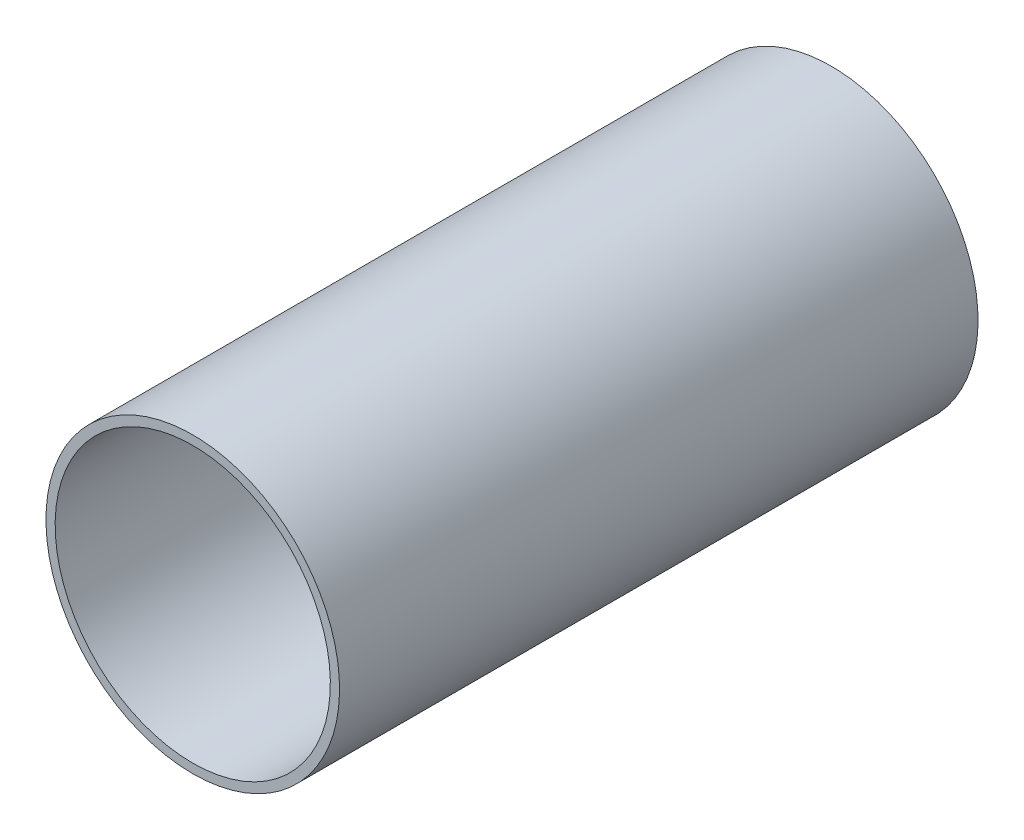
ISO-10303-21;
HEADER;
FILE_DESCRIPTION(('STEP AP214'),'2;1');
FILE_NAME('part.step','',(''),(''),'','','');
FILE_SCHEMA(('AUTOMOTIVE_DESIGN { 1 0 10303 214 1 1 1 1 }'));
ENDSEC;
DATA;
#1=APPLICATION_CONTEXT('core data for automotive mechanical design processes');
#2=APPLICATION_PROTOCOL_DEFINITION('international standard','automotive_design',2000,#1);
#3=PRODUCT_CONTEXT('',#1,'mechanical');
#4=PRODUCT('Part','Part','',(#3));
#5=PRODUCT_RELATED_PRODUCT_CATEGORY('part','',(#4));
#6=PRODUCT_DEFINITION_FORMATION('','',#4);
#7=PRODUCT_DEFINITION_CONTEXT('part definition',#1,'design');
#8=PRODUCT_DEFINITION('design','',#6,#7);
#9=PRODUCT_DEFINITION_SHAPE('','',#8);
#10=(LENGTH_UNIT() NAMED_UNIT(*) SI_UNIT(.MILLI.,.METRE.));
#11=(NAMED_UNIT(*) PLANE_ANGLE_UNIT() SI_UNIT($,.RADIAN.));
#12=(NAMED_UNIT(*) SI_UNIT($,.STERADIAN.) SOLID_ANGLE_UNIT());
#13=UNCERTAINTY_MEASURE_WITH_UNIT(LENGTH_MEASURE(1.E-05),#10,'distance_accuracy_value','');
#14=(GEOMETRIC_REPRESENTATION_CONTEXT(3) GLOBAL_UNCERTAINTY_ASSIGNED_CONTEXT((#13)) GLOBAL_UNIT_ASSIGNED_CONTEXT((#10,
#11,#12)) REPRESENTATION_CONTEXT('',''));
#15=CARTESIAN_POINT('',(0.,0.,0.));
#16=DIRECTION('',(0.,0.,1.));
#17=DIRECTION('',(1.,0.,0.));
#18=AXIS2_PLACEMENT_3D('',#15,#16,#17);
#19=CARTESIAN_POINT('',(124.46,-103.632,-0.045));
#20=DIRECTION('',(0.,0.,-1.));
#21=DIRECTION('',(0.,-1.,0.));
#22=AXIS2_PLACEMENT_3D('',#19,#20,#21);
#23=CYLINDRICAL_SURFACE('',#22,0.375);
#24=CARTESIAN_POINT('',(124.46,-103.632,-0.035));
#25=DIRECTION('',(0.,0.,-1.));
#26=DIRECTION('',(0.,-1.,0.));
#27=AXIS2_PLACEMENT_3D('',#24,#25,#26);
#28=CIRCLE('',#27,0.375);
#29=CARTESIAN_POINT('',(124.46,-104.007,-0.035));
#30=VERTEX_POINT('',#29);
#31=EDGE_CURVE('E64',#30,#30,#28,.T.);
#32=ORIENTED_EDGE('',*,*,#31,.T.);
#33=DIRECTION('',(0.,0.,1.));
#34=VECTOR('',#33,1.);
#35=CARTESIAN_POINT('',(124.46,-104.007,-0.045));
#36=LINE('',#35,#34);
#37=CARTESIAN_POINT('',(124.46,-104.007,1.705));
#38=VERTEX_POINT('',#37);
#39=EDGE_CURVE('E11',#30,#38,#36,.T.);
#40=ORIENTED_EDGE('',*,*,#39,.T.);
#41=CARTESIAN_POINT('',(124.46,-103.632,1.705));
#42=DIRECTION('',(0.,0.,-1.));
#43=DIRECTION('',(0.,-1.,0.));
#44=AXIS2_PLACEMENT_3D('',#41,#42,#43);
#45=CIRCLE('',#44,0.375);
#46=EDGE_CURVE('E25',#38,#38,#45,.T.);
#47=ORIENTED_EDGE('',*,*,#46,.F.);
#48=ORIENTED_EDGE('',*,*,#39,.F.);
#49=EDGE_LOOP('',(#32,#40,#47,#48));
#50=FACE_BOUND('',#49,.T.);
#51=ADVANCED_FACE('F17',(#50),#23,.F.);
#52=CARTESIAN_POINT('',(124.46,-104.032,1.705));
#53=DIRECTION('',(0.,0.,1.));
#54=DIRECTION('',(1.,0.,0.));
#55=AXIS2_PLACEMENT_3D('',#52,#53,#54);
#56=PLANE('',#55);
#57=ORIENTED_EDGE('',*,*,#46,.T.);
#58=EDGE_LOOP('',(#57));
#59=FACE_BOUND('',#58,.T.);
#60=CARTESIAN_POINT('',(124.46,-103.632,1.705));
#61=DIRECTION('',(0.,0.,1.));
#62=DIRECTION('',(0.,-1.,0.));
#63=AXIS2_PLACEMENT_3D('',#60,#61,#62);
#64=CIRCLE('',#63,0.4);
#65=CARTESIAN_POINT('',(124.46,-104.032,1.705));
#66=VERTEX_POINT('',#65);
#67=EDGE_CURVE('E56',#66,#66,#64,.T.);
#68=ORIENTED_EDGE('',*,*,#67,.T.);
#69=EDGE_LOOP('',(#68));
#70=FACE_BOUND('',#69,.T.);
#71=ADVANCED_FACE('F73',(#59,#70),#56,.T.);
#72=CARTESIAN_POINT('',(124.46,-104.032,-0.035));
#73=DIRECTION('',(0.,0.,1.));
#74=DIRECTION('',(1.,0.,0.));
#75=AXIS2_PLACEMENT_3D('',#72,#73,#74);
#76=PLANE('',#75);
#77=ORIENTED_EDGE('',*,*,#31,.F.);
#78=EDGE_LOOP('',(#77));
#79=FACE_BOUND('',#78,.T.);
#80=CARTESIAN_POINT('',(124.46,-103.632,-0.035));
#81=DIRECTION('',(0.,0.,1.));
#82=DIRECTION('',(0.,-1.,0.));
#83=AXIS2_PLACEMENT_3D('',#80,#81,#82);
#84=CIRCLE('',#83,0.4);
#85=CARTESIAN_POINT('',(124.46,-104.032,-0.035));
#86=VERTEX_POINT('',#85);
#87=EDGE_CURVE('E55',#86,#86,#84,.T.);
#88=ORIENTED_EDGE('',*,*,#87,.F.);
#89=EDGE_LOOP('',(#88));
#90=FACE_BOUND('',#89,.T.);
#91=ADVANCED_FACE('F82',(#79,#90),#76,.F.);
#92=CARTESIAN_POINT('',(124.46,-103.632,-0.035));
#93=DIRECTION('',(0.,0.,-1.));
#94=DIRECTION('',(0.,-1.,0.));
#95=AXIS2_PLACEMENT_3D('',#92,#93,#94);
#96=CYLINDRICAL_SURFACE('',#95,0.4);
#97=ORIENTED_EDGE('',*,*,#87,.T.);
#98=DIRECTION('',(0.,0.,1.));
#99=VECTOR('',#98,1.);
#100=CARTESIAN_POINT('',(124.46,-104.032,-0.035));
#101=LINE('',#100,#99);
#102=EDGE_CURVE('E52',#86,#66,#101,.T.);
#103=ORIENTED_EDGE('',*,*,#102,.T.);
#104=ORIENTED_EDGE('',*,*,#67,.F.);
#105=ORIENTED_EDGE('',*,*,#102,.F.);
#106=EDGE_LOOP('',(#97,#103,#104,#105));
#107=FACE_BOUND('',#106,.T.);
#108=ADVANCED_FACE('F53',(#107),#96,.T.);
#109=CLOSED_SHELL('',(#51,#71,#91,#108));
#110=MANIFOLD_SOLID_BREP('B1',#109);
#111=ADVANCED_BREP_SHAPE_REPRESENTATION('',(#18,#110),#14);
#112=SHAPE_DEFINITION_REPRESENTATION(#9,#111);
ENDSEC;
END-ISO-10303-21;
